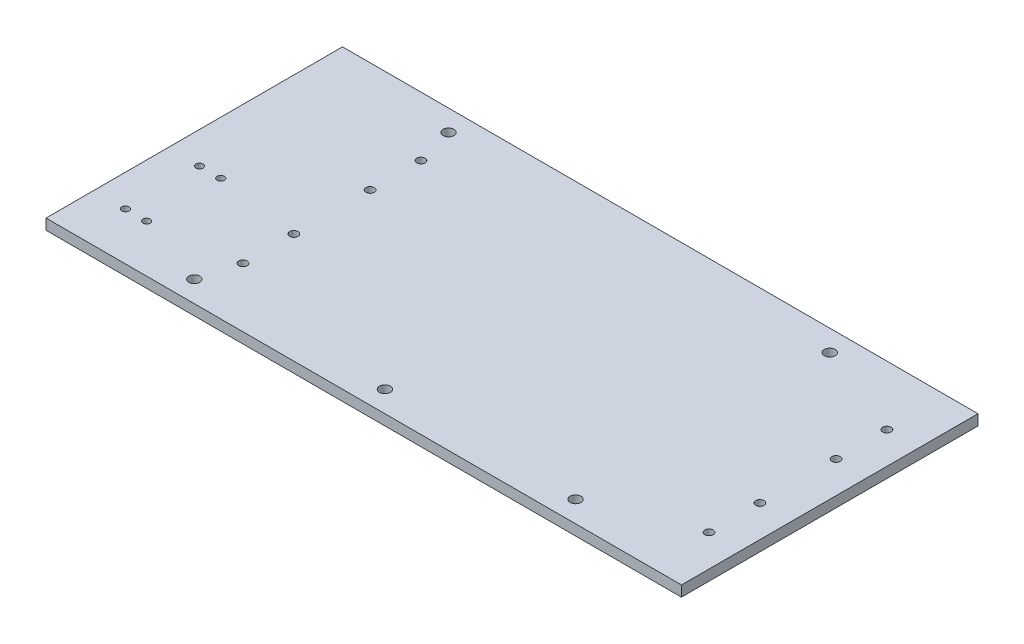
ISO-10303-21;
HEADER;
FILE_DESCRIPTION(('STEP AP214'),'2;1');
FILE_NAME('part.step','',(''),(''),'','','');
FILE_SCHEMA(('AUTOMOTIVE_DESIGN { 1 0 10303 214 1 1 1 1 }'));
ENDSEC;
DATA;
#1=APPLICATION_CONTEXT('core data for automotive mechanical design processes');
#2=APPLICATION_PROTOCOL_DEFINITION('international standard','automotive_design',2000,#1);
#3=PRODUCT_CONTEXT('',#1,'mechanical');
#4=PRODUCT('Part','Part','',(#3));
#5=PRODUCT_RELATED_PRODUCT_CATEGORY('part','',(#4));
#6=PRODUCT_DEFINITION_FORMATION('','',#4);
#7=PRODUCT_DEFINITION_CONTEXT('part definition',#1,'design');
#8=PRODUCT_DEFINITION('design','',#6,#7);
#9=PRODUCT_DEFINITION_SHAPE('','',#8);
#10=(LENGTH_UNIT() NAMED_UNIT(*) SI_UNIT(.MILLI.,.METRE.));
#11=(NAMED_UNIT(*) PLANE_ANGLE_UNIT() SI_UNIT($,.RADIAN.));
#12=(NAMED_UNIT(*) SI_UNIT($,.STERADIAN.) SOLID_ANGLE_UNIT());
#13=UNCERTAINTY_MEASURE_WITH_UNIT(LENGTH_MEASURE(1.E-05),#10,'distance_accuracy_value','');
#14=(GEOMETRIC_REPRESENTATION_CONTEXT(3) GLOBAL_UNCERTAINTY_ASSIGNED_CONTEXT((#13)) GLOBAL_UNIT_ASSIGNED_CONTEXT((#10,
#11,#12)) REPRESENTATION_CONTEXT('',''));
#15=CARTESIAN_POINT('',(0.,0.,0.));
#16=DIRECTION('',(0.,0.,1.));
#17=DIRECTION('',(1.,0.,0.));
#18=AXIS2_PLACEMENT_3D('',#15,#16,#17);
#19=CARTESIAN_POINT('',(-190.5,6.35,88.9));
#20=DIRECTION('',(1.,0.,0.));
#21=DIRECTION('',(0.,0.,-1.));
#22=AXIS2_PLACEMENT_3D('',#19,#20,#21);
#23=PLANE('',#22);
#24=DIRECTION('',(0.,0.,1.));
#25=VECTOR('',#24,1.);
#26=CARTESIAN_POINT('',(-190.5,0.,88.9));
#27=LINE('',#26,#25);
#28=CARTESIAN_POINT('',(-190.5,0.,-88.9));
#29=VERTEX_POINT('',#28);
#30=CARTESIAN_POINT('',(-190.5,0.,88.9));
#31=VERTEX_POINT('',#30);
#32=EDGE_CURVE('E111',#29,#31,#27,.T.);
#33=ORIENTED_EDGE('',*,*,#32,.T.);
#34=DIRECTION('',(0.,-1.,0.));
#35=VECTOR('',#34,1.);
#36=CARTESIAN_POINT('',(-190.5,6.35,88.9));
#37=LINE('',#36,#35);
#38=CARTESIAN_POINT('',(-190.5,6.35,88.9));
#39=VERTEX_POINT('',#38);
#40=EDGE_CURVE('E13',#39,#31,#37,.T.);
#41=ORIENTED_EDGE('',*,*,#40,.F.);
#42=DIRECTION('',(0.,0.,1.));
#43=VECTOR('',#42,1.);
#44=CARTESIAN_POINT('',(-190.5,6.35,88.9));
#45=LINE('',#44,#43);
#46=CARTESIAN_POINT('',(-190.5,6.35,-88.9));
#47=VERTEX_POINT('',#46);
#48=EDGE_CURVE('E99',#47,#39,#45,.T.);
#49=ORIENTED_EDGE('',*,*,#48,.F.);
#50=DIRECTION('',(0.,-1.,0.));
#51=VECTOR('',#50,1.);
#52=CARTESIAN_POINT('',(-190.5,6.35,-88.9));
#53=LINE('',#52,#51);
#54=EDGE_CURVE('E107',#47,#29,#53,.T.);
#55=ORIENTED_EDGE('',*,*,#54,.T.);
#56=EDGE_LOOP('',(#33,#41,#49,#55));
#57=FACE_BOUND('',#56,.T.);
#58=ADVANCED_FACE('F48',(#57),#23,.F.);
#59=CARTESIAN_POINT('',(-190.5,6.35,88.9));
#60=DIRECTION('',(0.,0.,-1.));
#61=DIRECTION('',(-1.,0.,0.));
#62=AXIS2_PLACEMENT_3D('',#59,#60,#61);
#63=PLANE('',#62);
#64=DIRECTION('',(1.,0.,0.));
#65=VECTOR('',#64,1.);
#66=CARTESIAN_POINT('',(-190.5,0.,88.9));
#67=LINE('',#66,#65);
#68=CARTESIAN_POINT('',(190.5,0.,88.9));
#69=VERTEX_POINT('',#68);
#70=EDGE_CURVE('E103',#31,#69,#67,.T.);
#71=ORIENTED_EDGE('',*,*,#70,.T.);
#72=DIRECTION('',(0.,-1.,0.));
#73=VECTOR('',#72,1.);
#74=CARTESIAN_POINT('',(190.5,6.35,88.9));
#75=LINE('',#74,#73);
#76=CARTESIAN_POINT('',(190.5,6.35,88.9));
#77=VERTEX_POINT('',#76);
#78=EDGE_CURVE('E56',#77,#69,#75,.T.);
#79=ORIENTED_EDGE('',*,*,#78,.F.);
#80=DIRECTION('',(1.,0.,0.));
#81=VECTOR('',#80,1.);
#82=CARTESIAN_POINT('',(-190.5,6.35,88.9));
#83=LINE('',#82,#81);
#84=EDGE_CURVE('E94',#39,#77,#83,.T.);
#85=ORIENTED_EDGE('',*,*,#84,.F.);
#86=ORIENTED_EDGE('',*,*,#40,.T.);
#87=EDGE_LOOP('',(#71,#79,#85,#86));
#88=FACE_BOUND('',#87,.T.);
#89=ADVANCED_FACE('F102',(#88),#63,.F.);
#90=CARTESIAN_POINT('',(190.5,6.35,88.9));
#91=DIRECTION('',(-1.,0.,0.));
#92=DIRECTION('',(0.,0.,1.));
#93=AXIS2_PLACEMENT_3D('',#90,#91,#92);
#94=PLANE('',#93);
#95=DIRECTION('',(0.,0.,-1.));
#96=VECTOR('',#95,1.);
#97=CARTESIAN_POINT('',(190.5,0.,88.9));
#98=LINE('',#97,#96);
#99=CARTESIAN_POINT('',(190.5,0.,-88.9));
#100=VERTEX_POINT('',#99);
#101=EDGE_CURVE('E81',#69,#100,#98,.T.);
#102=ORIENTED_EDGE('',*,*,#101,.T.);
#103=DIRECTION('',(0.,-1.,0.));
#104=VECTOR('',#103,1.);
#105=CARTESIAN_POINT('',(190.5,6.35,-88.9));
#106=LINE('',#105,#104);
#107=CARTESIAN_POINT('',(190.5,6.35,-88.9));
#108=VERTEX_POINT('',#107);
#109=EDGE_CURVE('E104',#108,#100,#106,.T.);
#110=ORIENTED_EDGE('',*,*,#109,.F.);
#111=DIRECTION('',(0.,0.,-1.));
#112=VECTOR('',#111,1.);
#113=CARTESIAN_POINT('',(190.5,6.35,88.9));
#114=LINE('',#113,#112);
#115=EDGE_CURVE('E97',#77,#108,#114,.T.);
#116=ORIENTED_EDGE('',*,*,#115,.F.);
#117=ORIENTED_EDGE('',*,*,#78,.T.);
#118=EDGE_LOOP('',(#102,#110,#116,#117));
#119=FACE_BOUND('',#118,.T.);
#120=ADVANCED_FACE('F105',(#119),#94,.F.);
#121=CARTESIAN_POINT('',(-190.5,6.35,-88.9));
#122=DIRECTION('',(0.,0.,1.));
#123=DIRECTION('',(1.,0.,0.));
#124=AXIS2_PLACEMENT_3D('',#121,#122,#123);
#125=PLANE('',#124);
#126=DIRECTION('',(-1.,0.,0.));
#127=VECTOR('',#126,1.);
#128=CARTESIAN_POINT('',(-190.5,0.,-88.9));
#129=LINE('',#128,#127);
#130=EDGE_CURVE('E87',#100,#29,#129,.T.);
#131=ORIENTED_EDGE('',*,*,#130,.T.);
#132=ORIENTED_EDGE('',*,*,#54,.F.);
#133=DIRECTION('',(-1.,0.,0.));
#134=VECTOR('',#133,1.);
#135=CARTESIAN_POINT('',(-190.5,6.35,-88.9));
#136=LINE('',#135,#134);
#137=EDGE_CURVE('E64',#108,#47,#136,.T.);
#138=ORIENTED_EDGE('',*,*,#137,.F.);
#139=ORIENTED_EDGE('',*,*,#109,.T.);
#140=EDGE_LOOP('',(#131,#132,#138,#139));
#141=FACE_BOUND('',#140,.T.);
#142=ADVANCED_FACE('F119',(#141),#125,.F.);
#143=CARTESIAN_POINT('',(0.,6.35,0.));
#144=DIRECTION('',(0.,-1.,0.));
#145=DIRECTION('',(0.,0.,-1.));
#146=AXIS2_PLACEMENT_3D('',#143,#144,#145);
#147=PLANE('',#146);
#148=CARTESIAN_POINT('',(-158.75,6.35,60.325));
#149=DIRECTION('',(0.,-1.,0.));
#150=DIRECTION('',(0.,0.,-1.));
#151=AXIS2_PLACEMENT_3D('',#148,#149,#150);
#152=CIRCLE('',#151,2.15265000000001);
#153=CARTESIAN_POINT('',(-158.75,6.35,58.17235));
#154=VERTEX_POINT('',#153);
#155=EDGE_CURVE('E208',#154,#154,#152,.F.);
#156=ORIENTED_EDGE('',*,*,#155,.F.);
#157=EDGE_LOOP('',(#156));
#158=FACE_BOUND('',#157,.T.);
#159=CARTESIAN_POINT('',(-171.45,6.35,15.875));
#160=DIRECTION('',(0.,-1.,0.));
#161=DIRECTION('',(0.,0.,-1.));
#162=AXIS2_PLACEMENT_3D('',#159,#160,#161);
#163=CIRCLE('',#162,2.15265000000001);
#164=CARTESIAN_POINT('',(-171.45,6.35,13.72235));
#165=VERTEX_POINT('',#164);
#166=EDGE_CURVE('E209',#165,#165,#163,.F.);
#167=ORIENTED_EDGE('',*,*,#166,.F.);
#168=EDGE_LOOP('',(#167));
#169=FACE_BOUND('',#168,.T.);
#170=CARTESIAN_POINT('',(-158.75,6.35,15.875));
#171=DIRECTION('',(0.,-1.,0.));
#172=DIRECTION('',(0.,0.,-1.));
#173=AXIS2_PLACEMENT_3D('',#170,#171,#172);
#174=CIRCLE('',#173,2.15265000000001);
#175=CARTESIAN_POINT('',(-158.75,6.35,13.72235));
#176=VERTEX_POINT('',#175);
#177=EDGE_CURVE('E216',#176,#176,#174,.F.);
#178=ORIENTED_EDGE('',*,*,#177,.F.);
#179=EDGE_LOOP('',(#178));
#180=FACE_BOUND('',#179,.T.);
#181=CARTESIAN_POINT('',(-171.45,6.35,60.325));
#182=DIRECTION('',(0.,-1.,0.));
#183=DIRECTION('',(0.,0.,-1.));
#184=AXIS2_PLACEMENT_3D('',#181,#182,#183);
#185=CIRCLE('',#184,2.15265000000001);
#186=CARTESIAN_POINT('',(-171.45,6.35,58.17235));
#187=VERTEX_POINT('',#186);
#188=EDGE_CURVE('E192',#187,#187,#185,.F.);
#189=ORIENTED_EDGE('',*,*,#188,.F.);
#190=EDGE_LOOP('',(#189));
#191=FACE_BOUND('',#190,.T.);
#192=CARTESIAN_POINT('',(-107.95,6.35,-22.86));
#193=DIRECTION('',(0.,-1.,0.));
#194=DIRECTION('',(0.,0.,-1.));
#195=AXIS2_PLACEMENT_3D('',#192,#193,#194);
#196=CIRCLE('',#195,2.5019);
#197=CARTESIAN_POINT('',(-107.95,6.35,-25.3619));
#198=VERTEX_POINT('',#197);
#199=EDGE_CURVE('E173',#198,#198,#196,.F.);
#200=ORIENTED_EDGE('',*,*,#199,.F.);
#201=EDGE_LOOP('',(#200));
#202=FACE_BOUND('',#201,.T.);
#203=CARTESIAN_POINT('',(171.45,6.35,-22.86));
#204=DIRECTION('',(0.,-1.,0.));
#205=DIRECTION('',(0.,0.,-1.));
#206=AXIS2_PLACEMENT_3D('',#203,#204,#205);
#207=CIRCLE('',#206,2.5019);
#208=CARTESIAN_POINT('',(171.45,6.35,-25.3619));
#209=VERTEX_POINT('',#208);
#210=EDGE_CURVE('E168',#209,#209,#207,.F.);
#211=ORIENTED_EDGE('',*,*,#210,.F.);
#212=EDGE_LOOP('',(#211));
#213=FACE_BOUND('',#212,.T.);
#214=CARTESIAN_POINT('',(171.45,6.35,-53.34));
#215=DIRECTION('',(0.,-1.,0.));
#216=DIRECTION('',(0.,0.,-1.));
#217=AXIS2_PLACEMENT_3D('',#214,#215,#216);
#218=CIRCLE('',#217,2.50190000000001);
#219=CARTESIAN_POINT('',(171.45,6.35,-55.8419));
#220=VERTEX_POINT('',#219);
#221=EDGE_CURVE('E161',#220,#220,#218,.F.);
#222=ORIENTED_EDGE('',*,*,#221,.F.);
#223=EDGE_LOOP('',(#222));
#224=FACE_BOUND('',#223,.T.);
#225=CARTESIAN_POINT('',(171.45,6.35,53.34));
#226=DIRECTION('',(0.,-1.,0.));
#227=DIRECTION('',(0.,0.,-1.));
#228=AXIS2_PLACEMENT_3D('',#225,#226,#227);
#229=CIRCLE('',#228,2.50190000000001);
#230=CARTESIAN_POINT('',(171.45,6.35,50.8381));
#231=VERTEX_POINT('',#230);
#232=EDGE_CURVE('E160',#231,#231,#229,.F.);
#233=ORIENTED_EDGE('',*,*,#232,.F.);
#234=EDGE_LOOP('',(#233));
#235=FACE_BOUND('',#234,.T.);
#236=CARTESIAN_POINT('',(-107.95,6.35,-53.34));
#237=DIRECTION('',(0.,-1.,0.));
#238=DIRECTION('',(0.,0.,-1.));
#239=AXIS2_PLACEMENT_3D('',#236,#237,#238);
#240=CIRCLE('',#239,2.50190000000001);
#241=CARTESIAN_POINT('',(-107.95,6.35,-55.8419));
#242=VERTEX_POINT('',#241);
#243=EDGE_CURVE('E180',#242,#242,#240,.F.);
#244=ORIENTED_EDGE('',*,*,#243,.F.);
#245=EDGE_LOOP('',(#244));
#246=FACE_BOUND('',#245,.T.);
#247=CARTESIAN_POINT('',(171.45,6.35,22.86));
#248=DIRECTION('',(0.,-1.,0.));
#249=DIRECTION('',(0.,0.,-1.));
#250=AXIS2_PLACEMENT_3D('',#247,#248,#249);
#251=CIRCLE('',#250,2.5019);
#252=CARTESIAN_POINT('',(171.45,6.35,20.3581));
#253=VERTEX_POINT('',#252);
#254=EDGE_CURVE('E193',#253,#253,#251,.F.);
#255=ORIENTED_EDGE('',*,*,#254,.F.);
#256=EDGE_LOOP('',(#255));
#257=FACE_BOUND('',#256,.T.);
#258=CARTESIAN_POINT('',(-107.95,6.35,53.34));
#259=DIRECTION('',(0.,-1.,0.));
#260=DIRECTION('',(0.,0.,-1.));
#261=AXIS2_PLACEMENT_3D('',#258,#259,#260);
#262=CIRCLE('',#261,2.50190000000001);
#263=CARTESIAN_POINT('',(-107.95,6.35,50.8381));
#264=VERTEX_POINT('',#263);
#265=EDGE_CURVE('E185',#264,#264,#262,.F.);
#266=ORIENTED_EDGE('',*,*,#265,.F.);
#267=EDGE_LOOP('',(#266));
#268=FACE_BOUND('',#267,.T.);
#269=CARTESIAN_POINT('',(-107.95,6.35,22.86));
#270=DIRECTION('',(0.,-1.,0.));
#271=DIRECTION('',(0.,0.,-1.));
#272=AXIS2_PLACEMENT_3D('',#269,#270,#271);
#273=CIRCLE('',#272,2.5019);
#274=CARTESIAN_POINT('',(-107.95,6.35,20.3581));
#275=VERTEX_POINT('',#274);
#276=EDGE_CURVE('E138',#275,#275,#273,.F.);
#277=ORIENTED_EDGE('',*,*,#276,.F.);
#278=EDGE_LOOP('',(#277));
#279=FACE_BOUND('',#278,.T.);
#280=CARTESIAN_POINT('',(114.3,6.35,-76.2));
#281=DIRECTION('',(0.,-1.,0.));
#282=DIRECTION('',(0.,0.,-1.));
#283=AXIS2_PLACEMENT_3D('',#280,#281,#282);
#284=CIRCLE('',#283,3.26389999999999);
#285=CARTESIAN_POINT('',(114.3,6.35,-79.4639));
#286=VERTEX_POINT('',#285);
#287=EDGE_CURVE('E131',#286,#286,#284,.F.);
#288=ORIENTED_EDGE('',*,*,#287,.F.);
#289=EDGE_LOOP('',(#288));
#290=FACE_BOUND('',#289,.T.);
#291=CARTESIAN_POINT('',(-114.3,6.35,-76.2));
#292=DIRECTION('',(0.,-1.,0.));
#293=DIRECTION('',(0.,0.,-1.));
#294=AXIS2_PLACEMENT_3D('',#291,#292,#293);
#295=CIRCLE('',#294,3.26389999999999);
#296=CARTESIAN_POINT('',(-114.3,6.35,-79.4639));
#297=VERTEX_POINT('',#296);
#298=EDGE_CURVE('E139',#297,#297,#295,.F.);
#299=ORIENTED_EDGE('',*,*,#298,.F.);
#300=EDGE_LOOP('',(#299));
#301=FACE_BOUND('',#300,.T.);
#302=CARTESIAN_POINT('',(114.3,6.35,76.2));
#303=DIRECTION('',(0.,-1.,0.));
#304=DIRECTION('',(0.,0.,-1.));
#305=AXIS2_PLACEMENT_3D('',#302,#303,#304);
#306=CIRCLE('',#305,3.26389999999999);
#307=CARTESIAN_POINT('',(114.3,6.35,72.9361));
#308=VERTEX_POINT('',#307);
#309=EDGE_CURVE('E145',#308,#308,#306,.F.);
#310=ORIENTED_EDGE('',*,*,#309,.F.);
#311=EDGE_LOOP('',(#310));
#312=FACE_BOUND('',#311,.T.);
#313=CARTESIAN_POINT('',(-114.3,6.35,76.2));
#314=DIRECTION('',(0.,-1.,0.));
#315=DIRECTION('',(0.,0.,-1.));
#316=AXIS2_PLACEMENT_3D('',#313,#314,#315);
#317=CIRCLE('',#316,3.26389999999999);
#318=CARTESIAN_POINT('',(-114.3,6.35,72.9361));
#319=VERTEX_POINT('',#318);
#320=EDGE_CURVE('E130',#319,#319,#317,.F.);
#321=ORIENTED_EDGE('',*,*,#320,.F.);
#322=EDGE_LOOP('',(#321));
#323=FACE_BOUND('',#322,.T.);
#324=CARTESIAN_POINT('',(0.,6.35,76.2));
#325=DIRECTION('',(0.,-1.,0.));
#326=DIRECTION('',(0.,0.,-1.));
#327=AXIS2_PLACEMENT_3D('',#324,#325,#326);
#328=CIRCLE('',#327,3.2639);
#329=CARTESIAN_POINT('',(0.,6.35,72.9361));
#330=VERTEX_POINT('',#329);
#331=EDGE_CURVE('E114',#330,#330,#328,.F.);
#332=ORIENTED_EDGE('',*,*,#331,.F.);
#333=EDGE_LOOP('',(#332));
#334=FACE_BOUND('',#333,.T.);
#335=ORIENTED_EDGE('',*,*,#48,.T.);
#336=ORIENTED_EDGE('',*,*,#84,.T.);
#337=ORIENTED_EDGE('',*,*,#115,.T.);
#338=ORIENTED_EDGE('',*,*,#137,.T.);
#339=EDGE_LOOP('',(#335,#336,#337,#338));
#340=FACE_BOUND('',#339,.T.);
#341=ADVANCED_FACE('F95',(#158,#169,#180,#191,#202,#213,#224,#235,#246,#257,#268,#279,#290,#301,
#312,#323,#334,#340),#147,.F.);
#342=CARTESIAN_POINT('',(0.,0.,0.));
#343=DIRECTION('',(0.,-1.,0.));
#344=DIRECTION('',(0.,0.,-1.));
#345=AXIS2_PLACEMENT_3D('',#342,#343,#344);
#346=PLANE('',#345);
#347=CARTESIAN_POINT('',(-158.75,0.,60.325));
#348=DIRECTION('',(0.,-1.,0.));
#349=DIRECTION('',(0.,0.,-1.));
#350=AXIS2_PLACEMENT_3D('',#347,#348,#349);
#351=CIRCLE('',#350,2.15265000000001);
#352=CARTESIAN_POINT('',(-158.75,0.,58.17235));
#353=VERTEX_POINT('',#352);
#354=EDGE_CURVE('E212',#353,#353,#351,.T.);
#355=ORIENTED_EDGE('',*,*,#354,.F.);
#356=EDGE_LOOP('',(#355));
#357=FACE_BOUND('',#356,.T.);
#358=CARTESIAN_POINT('',(-171.45,0.,15.875));
#359=DIRECTION('',(0.,-1.,0.));
#360=DIRECTION('',(0.,0.,-1.));
#361=AXIS2_PLACEMENT_3D('',#358,#359,#360);
#362=CIRCLE('',#361,2.15265000000001);
#363=CARTESIAN_POINT('',(-171.45,0.,13.72235));
#364=VERTEX_POINT('',#363);
#365=EDGE_CURVE('E213',#364,#364,#362,.T.);
#366=ORIENTED_EDGE('',*,*,#365,.F.);
#367=EDGE_LOOP('',(#366));
#368=FACE_BOUND('',#367,.T.);
#369=CARTESIAN_POINT('',(-158.75,0.,15.875));
#370=DIRECTION('',(0.,-1.,0.));
#371=DIRECTION('',(0.,0.,-1.));
#372=AXIS2_PLACEMENT_3D('',#369,#370,#371);
#373=CIRCLE('',#372,2.15265000000001);
#374=CARTESIAN_POINT('',(-158.75,0.,13.72235));
#375=VERTEX_POINT('',#374);
#376=EDGE_CURVE('E223',#375,#375,#373,.T.);
#377=ORIENTED_EDGE('',*,*,#376,.F.);
#378=EDGE_LOOP('',(#377));
#379=FACE_BOUND('',#378,.T.);
#380=CARTESIAN_POINT('',(-171.45,0.,60.325));
#381=DIRECTION('',(0.,-1.,0.));
#382=DIRECTION('',(0.,0.,-1.));
#383=AXIS2_PLACEMENT_3D('',#380,#381,#382);
#384=CIRCLE('',#383,2.15265000000001);
#385=CARTESIAN_POINT('',(-171.45,0.,58.17235));
#386=VERTEX_POINT('',#385);
#387=EDGE_CURVE('E205',#386,#386,#384,.T.);
#388=ORIENTED_EDGE('',*,*,#387,.F.);
#389=EDGE_LOOP('',(#388));
#390=FACE_BOUND('',#389,.T.);
#391=CARTESIAN_POINT('',(-107.95,0.,-22.86));
#392=DIRECTION('',(0.,-1.,0.));
#393=DIRECTION('',(0.,0.,1.));
#394=AXIS2_PLACEMENT_3D('',#391,#392,#393);
#395=CIRCLE('',#394,2.5019);
#396=CARTESIAN_POINT('',(-107.95,0.,-20.3581));
#397=VERTEX_POINT('',#396);
#398=EDGE_CURVE('E177',#397,#397,#395,.T.);
#399=ORIENTED_EDGE('',*,*,#398,.F.);
#400=EDGE_LOOP('',(#399));
#401=FACE_BOUND('',#400,.T.);
#402=CARTESIAN_POINT('',(171.45,0.,-22.86));
#403=DIRECTION('',(0.,-1.,0.));
#404=DIRECTION('',(0.,0.,1.));
#405=AXIS2_PLACEMENT_3D('',#402,#403,#404);
#406=CIRCLE('',#405,2.5019);
#407=CARTESIAN_POINT('',(171.45,0.,-20.3581));
#408=VERTEX_POINT('',#407);
#409=EDGE_CURVE('E176',#408,#408,#406,.T.);
#410=ORIENTED_EDGE('',*,*,#409,.F.);
#411=EDGE_LOOP('',(#410));
#412=FACE_BOUND('',#411,.T.);
#413=CARTESIAN_POINT('',(171.45,0.,-53.34));
#414=DIRECTION('',(0.,-1.,0.));
#415=DIRECTION('',(0.,0.,1.));
#416=AXIS2_PLACEMENT_3D('',#413,#414,#415);
#417=CIRCLE('',#416,2.50190000000001);
#418=CARTESIAN_POINT('',(171.45,0.,-50.8381));
#419=VERTEX_POINT('',#418);
#420=EDGE_CURVE('E165',#419,#419,#417,.T.);
#421=ORIENTED_EDGE('',*,*,#420,.F.);
#422=EDGE_LOOP('',(#421));
#423=FACE_BOUND('',#422,.T.);
#424=CARTESIAN_POINT('',(171.45,0.,53.34));
#425=DIRECTION('',(0.,-1.,0.));
#426=DIRECTION('',(0.,0.,-1.));
#427=AXIS2_PLACEMENT_3D('',#424,#425,#426);
#428=CIRCLE('',#427,2.50190000000001);
#429=CARTESIAN_POINT('',(171.45,0.,50.8381));
#430=VERTEX_POINT('',#429);
#431=EDGE_CURVE('E164',#430,#430,#428,.T.);
#432=ORIENTED_EDGE('',*,*,#431,.F.);
#433=EDGE_LOOP('',(#432));
#434=FACE_BOUND('',#433,.T.);
#435=CARTESIAN_POINT('',(-107.95,0.,-53.34));
#436=DIRECTION('',(0.,-1.,0.));
#437=DIRECTION('',(0.,0.,-1.));
#438=AXIS2_PLACEMENT_3D('',#435,#436,#437);
#439=CIRCLE('',#438,2.50190000000001);
#440=CARTESIAN_POINT('',(-107.95,0.,-55.8419));
#441=VERTEX_POINT('',#440);
#442=EDGE_CURVE('E196',#441,#441,#439,.T.);
#443=ORIENTED_EDGE('',*,*,#442,.F.);
#444=EDGE_LOOP('',(#443));
#445=FACE_BOUND('',#444,.T.);
#446=CARTESIAN_POINT('',(171.45,0.,22.86));
#447=DIRECTION('',(0.,-1.,0.));
#448=DIRECTION('',(0.,0.,-1.));
#449=AXIS2_PLACEMENT_3D('',#446,#447,#448);
#450=CIRCLE('',#449,2.5019);
#451=CARTESIAN_POINT('',(171.45,0.,20.3581));
#452=VERTEX_POINT('',#451);
#453=EDGE_CURVE('E188',#452,#452,#450,.T.);
#454=ORIENTED_EDGE('',*,*,#453,.F.);
#455=EDGE_LOOP('',(#454));
#456=FACE_BOUND('',#455,.T.);
#457=CARTESIAN_POINT('',(-107.95,0.,53.34));
#458=DIRECTION('',(0.,-1.,0.));
#459=DIRECTION('',(0.,0.,1.));
#460=AXIS2_PLACEMENT_3D('',#457,#458,#459);
#461=CIRCLE('',#460,2.50190000000001);
#462=CARTESIAN_POINT('',(-107.95,0.,55.8419));
#463=VERTEX_POINT('',#462);
#464=EDGE_CURVE('E189',#463,#463,#461,.T.);
#465=ORIENTED_EDGE('',*,*,#464,.F.);
#466=EDGE_LOOP('',(#465));
#467=FACE_BOUND('',#466,.T.);
#468=CARTESIAN_POINT('',(-107.95,0.,22.86));
#469=DIRECTION('',(0.,-1.,0.));
#470=DIRECTION('',(0.,0.,-1.));
#471=AXIS2_PLACEMENT_3D('',#468,#469,#470);
#472=CIRCLE('',#471,2.5019);
#473=CARTESIAN_POINT('',(-107.95,0.,20.3581));
#474=VERTEX_POINT('',#473);
#475=EDGE_CURVE('E157',#474,#474,#472,.T.);
#476=ORIENTED_EDGE('',*,*,#475,.F.);
#477=EDGE_LOOP('',(#476));
#478=FACE_BOUND('',#477,.T.);
#479=CARTESIAN_POINT('',(114.3,0.,-76.2));
#480=DIRECTION('',(0.,-1.,0.));
#481=DIRECTION('',(0.,0.,-1.));
#482=AXIS2_PLACEMENT_3D('',#479,#480,#481);
#483=CIRCLE('',#482,3.26389999999999);
#484=CARTESIAN_POINT('',(114.3,0.,-79.4639));
#485=VERTEX_POINT('',#484);
#486=EDGE_CURVE('E135',#485,#485,#483,.T.);
#487=ORIENTED_EDGE('',*,*,#486,.F.);
#488=EDGE_LOOP('',(#487));
#489=FACE_BOUND('',#488,.T.);
#490=CARTESIAN_POINT('',(-114.3,0.,-76.2));
#491=DIRECTION('',(0.,-1.,0.));
#492=DIRECTION('',(0.,0.,-1.));
#493=AXIS2_PLACEMENT_3D('',#490,#491,#492);
#494=CIRCLE('',#493,3.26389999999999);
#495=CARTESIAN_POINT('',(-114.3,0.,-79.4639));
#496=VERTEX_POINT('',#495);
#497=EDGE_CURVE('E134',#496,#496,#494,.T.);
#498=ORIENTED_EDGE('',*,*,#497,.F.);
#499=EDGE_LOOP('',(#498));
#500=FACE_BOUND('',#499,.T.);
#501=CARTESIAN_POINT('',(114.3,0.,76.2));
#502=DIRECTION('',(0.,-1.,0.));
#503=DIRECTION('',(0.,0.,-1.));
#504=AXIS2_PLACEMENT_3D('',#501,#502,#503);
#505=CIRCLE('',#504,3.26389999999999);
#506=CARTESIAN_POINT('',(114.3,0.,72.9361));
#507=VERTEX_POINT('',#506);
#508=EDGE_CURVE('E142',#507,#507,#505,.T.);
#509=ORIENTED_EDGE('',*,*,#508,.F.);
#510=EDGE_LOOP('',(#509));
#511=FACE_BOUND('',#510,.T.);
#512=CARTESIAN_POINT('',(-114.3,0.,76.2));
#513=DIRECTION('',(0.,-1.,0.));
#514=DIRECTION('',(0.,0.,-1.));
#515=AXIS2_PLACEMENT_3D('',#512,#513,#514);
#516=CIRCLE('',#515,3.26389999999999);
#517=CARTESIAN_POINT('',(-114.3,0.,72.9361));
#518=VERTEX_POINT('',#517);
#519=EDGE_CURVE('E148',#518,#518,#516,.T.);
#520=ORIENTED_EDGE('',*,*,#519,.F.);
#521=EDGE_LOOP('',(#520));
#522=FACE_BOUND('',#521,.T.);
#523=CARTESIAN_POINT('',(0.,0.,76.2));
#524=DIRECTION('',(0.,-1.,0.));
#525=DIRECTION('',(0.,0.,-1.));
#526=AXIS2_PLACEMENT_3D('',#523,#524,#525);
#527=CIRCLE('',#526,3.2639);
#528=CARTESIAN_POINT('',(0.,0.,72.9361));
#529=VERTEX_POINT('',#528);
#530=EDGE_CURVE('E127',#529,#529,#527,.T.);
#531=ORIENTED_EDGE('',*,*,#530,.F.);
#532=EDGE_LOOP('',(#531));
#533=FACE_BOUND('',#532,.T.);
#534=ORIENTED_EDGE('',*,*,#32,.F.);
#535=ORIENTED_EDGE('',*,*,#130,.F.);
#536=ORIENTED_EDGE('',*,*,#101,.F.);
#537=ORIENTED_EDGE('',*,*,#70,.F.);
#538=EDGE_LOOP('',(#534,#535,#536,#537));
#539=FACE_BOUND('',#538,.T.);
#540=ADVANCED_FACE('F122',(#357,#368,#379,#390,#401,#412,#423,#434,#445,#456,#467,#478,#489,
#500,#511,#522,#533,#539),#346,.T.);
#541=CARTESIAN_POINT('',(0.,15.5817032924591,76.2));
#542=DIRECTION('',(0.,-1.,0.));
#543=DIRECTION('',(0.,0.,-1.));
#544=AXIS2_PLACEMENT_3D('',#541,#542,#543);
#545=CYLINDRICAL_SURFACE('',#544,3.2639);
#546=ORIENTED_EDGE('',*,*,#331,.T.);
#547=EDGE_LOOP('',(#546));
#548=FACE_BOUND('',#547,.T.);
#549=ORIENTED_EDGE('',*,*,#530,.T.);
#550=EDGE_LOOP('',(#549));
#551=FACE_BOUND('',#550,.T.);
#552=ADVANCED_FACE('F231',(#548,#551),#545,.F.);
#553=CARTESIAN_POINT('',(-114.3,15.5817032924591,76.2));
#554=DIRECTION('',(0.,-1.,0.));
#555=DIRECTION('',(0.,0.,-1.));
#556=AXIS2_PLACEMENT_3D('',#553,#554,#555);
#557=CYLINDRICAL_SURFACE('',#556,3.26389999999999);
#558=ORIENTED_EDGE('',*,*,#320,.T.);
#559=EDGE_LOOP('',(#558));
#560=FACE_BOUND('',#559,.T.);
#561=ORIENTED_EDGE('',*,*,#519,.T.);
#562=EDGE_LOOP('',(#561));
#563=FACE_BOUND('',#562,.T.);
#564=ADVANCED_FACE('F263',(#560,#563),#557,.F.);
#565=CARTESIAN_POINT('',(114.3,15.5817032924591,76.2));
#566=DIRECTION('',(0.,-1.,0.));
#567=DIRECTION('',(0.,0.,-1.));
#568=AXIS2_PLACEMENT_3D('',#565,#566,#567);
#569=CYLINDRICAL_SURFACE('',#568,3.26389999999999);
#570=ORIENTED_EDGE('',*,*,#309,.T.);
#571=EDGE_LOOP('',(#570));
#572=FACE_BOUND('',#571,.T.);
#573=ORIENTED_EDGE('',*,*,#508,.T.);
#574=EDGE_LOOP('',(#573));
#575=FACE_BOUND('',#574,.T.);
#576=ADVANCED_FACE('F269',(#572,#575),#569,.F.);
#577=CARTESIAN_POINT('',(-114.3,15.5817032924591,-76.2));
#578=DIRECTION('',(0.,-1.,0.));
#579=DIRECTION('',(0.,0.,-1.));
#580=AXIS2_PLACEMENT_3D('',#577,#578,#579);
#581=CYLINDRICAL_SURFACE('',#580,3.26389999999999);
#582=ORIENTED_EDGE('',*,*,#298,.T.);
#583=EDGE_LOOP('',(#582));
#584=FACE_BOUND('',#583,.T.);
#585=ORIENTED_EDGE('',*,*,#497,.T.);
#586=EDGE_LOOP('',(#585));
#587=FACE_BOUND('',#586,.T.);
#588=ADVANCED_FACE('F325',(#584,#587),#581,.F.);
#589=CARTESIAN_POINT('',(114.3,15.5817032924591,-76.2));
#590=DIRECTION('',(0.,-1.,0.));
#591=DIRECTION('',(0.,0.,-1.));
#592=AXIS2_PLACEMENT_3D('',#589,#590,#591);
#593=CYLINDRICAL_SURFACE('',#592,3.26389999999999);
#594=ORIENTED_EDGE('',*,*,#287,.T.);
#595=EDGE_LOOP('',(#594));
#596=FACE_BOUND('',#595,.T.);
#597=ORIENTED_EDGE('',*,*,#486,.T.);
#598=EDGE_LOOP('',(#597));
#599=FACE_BOUND('',#598,.T.);
#600=ADVANCED_FACE('F330',(#596,#599),#593,.F.);
#601=CARTESIAN_POINT('',(-107.95,13.4264418234025,22.86));
#602=DIRECTION('',(0.,-1.,0.));
#603=DIRECTION('',(0.,0.,-1.));
#604=AXIS2_PLACEMENT_3D('',#601,#602,#603);
#605=CYLINDRICAL_SURFACE('',#604,2.5019);
#606=ORIENTED_EDGE('',*,*,#276,.T.);
#607=EDGE_LOOP('',(#606));
#608=FACE_BOUND('',#607,.T.);
#609=ORIENTED_EDGE('',*,*,#475,.T.);
#610=EDGE_LOOP('',(#609));
#611=FACE_BOUND('',#610,.T.);
#612=ADVANCED_FACE('F335',(#608,#611),#605,.F.);
#613=CARTESIAN_POINT('',(-107.95,13.4264418234025,53.34));
#614=DIRECTION('',(0.,-1.,0.));
#615=DIRECTION('',(0.,0.,-1.));
#616=AXIS2_PLACEMENT_3D('',#613,#614,#615);
#617=CYLINDRICAL_SURFACE('',#616,2.50190000000001);
#618=ORIENTED_EDGE('',*,*,#265,.T.);
#619=EDGE_LOOP('',(#618));
#620=FACE_BOUND('',#619,.T.);
#621=ORIENTED_EDGE('',*,*,#464,.T.);
#622=EDGE_LOOP('',(#621));
#623=FACE_BOUND('',#622,.T.);
#624=ADVANCED_FACE('F340',(#620,#623),#617,.F.);
#625=CARTESIAN_POINT('',(171.45,13.4264418234025,22.86));
#626=DIRECTION('',(0.,-1.,0.));
#627=DIRECTION('',(0.,0.,-1.));
#628=AXIS2_PLACEMENT_3D('',#625,#626,#627);
#629=CYLINDRICAL_SURFACE('',#628,2.5019);
#630=ORIENTED_EDGE('',*,*,#254,.T.);
#631=EDGE_LOOP('',(#630));
#632=FACE_BOUND('',#631,.T.);
#633=ORIENTED_EDGE('',*,*,#453,.T.);
#634=EDGE_LOOP('',(#633));
#635=FACE_BOUND('',#634,.T.);
#636=ADVANCED_FACE('F346',(#632,#635),#629,.F.);
#637=CARTESIAN_POINT('',(-107.95,13.4264418234025,-53.34));
#638=DIRECTION('',(0.,-1.,0.));
#639=DIRECTION('',(0.,0.,-1.));
#640=AXIS2_PLACEMENT_3D('',#637,#638,#639);
#641=CYLINDRICAL_SURFACE('',#640,2.50190000000001);
#642=ORIENTED_EDGE('',*,*,#243,.T.);
#643=EDGE_LOOP('',(#642));
#644=FACE_BOUND('',#643,.T.);
#645=ORIENTED_EDGE('',*,*,#442,.T.);
#646=EDGE_LOOP('',(#645));
#647=FACE_BOUND('',#646,.T.);
#648=ADVANCED_FACE('F359',(#644,#647),#641,.F.);
#649=CARTESIAN_POINT('',(171.45,13.4264418234025,53.34));
#650=DIRECTION('',(0.,-1.,0.));
#651=DIRECTION('',(0.,0.,-1.));
#652=AXIS2_PLACEMENT_3D('',#649,#650,#651);
#653=CYLINDRICAL_SURFACE('',#652,2.50190000000001);
#654=ORIENTED_EDGE('',*,*,#232,.T.);
#655=EDGE_LOOP('',(#654));
#656=FACE_BOUND('',#655,.T.);
#657=ORIENTED_EDGE('',*,*,#431,.T.);
#658=EDGE_LOOP('',(#657));
#659=FACE_BOUND('',#658,.T.);
#660=ADVANCED_FACE('F355',(#656,#659),#653,.F.);
#661=CARTESIAN_POINT('',(171.45,13.4264418234025,-53.34));
#662=DIRECTION('',(0.,-1.,0.));
#663=DIRECTION('',(0.,0.,-1.));
#664=AXIS2_PLACEMENT_3D('',#661,#662,#663);
#665=CYLINDRICAL_SURFACE('',#664,2.50190000000001);
#666=ORIENTED_EDGE('',*,*,#221,.T.);
#667=EDGE_LOOP('',(#666));
#668=FACE_BOUND('',#667,.T.);
#669=ORIENTED_EDGE('',*,*,#420,.T.);
#670=EDGE_LOOP('',(#669));
#671=FACE_BOUND('',#670,.T.);
#672=ADVANCED_FACE('F351',(#668,#671),#665,.F.);
#673=CARTESIAN_POINT('',(171.45,13.4264418234025,-22.86));
#674=DIRECTION('',(0.,-1.,0.));
#675=DIRECTION('',(0.,0.,-1.));
#676=AXIS2_PLACEMENT_3D('',#673,#674,#675);
#677=CYLINDRICAL_SURFACE('',#676,2.5019);
#678=ORIENTED_EDGE('',*,*,#210,.T.);
#679=EDGE_LOOP('',(#678));
#680=FACE_BOUND('',#679,.T.);
#681=ORIENTED_EDGE('',*,*,#409,.T.);
#682=EDGE_LOOP('',(#681));
#683=FACE_BOUND('',#682,.T.);
#684=ADVANCED_FACE('F354',(#680,#683),#677,.F.);
#685=CARTESIAN_POINT('',(-107.95,13.4264418234025,-22.86));
#686=DIRECTION('',(0.,-1.,0.));
#687=DIRECTION('',(0.,0.,-1.));
#688=AXIS2_PLACEMENT_3D('',#685,#686,#687);
#689=CYLINDRICAL_SURFACE('',#688,2.5019);
#690=ORIENTED_EDGE('',*,*,#199,.T.);
#691=EDGE_LOOP('',(#690));
#692=FACE_BOUND('',#691,.T.);
#693=ORIENTED_EDGE('',*,*,#398,.T.);
#694=EDGE_LOOP('',(#693));
#695=FACE_BOUND('',#694,.T.);
#696=ADVANCED_FACE('F361',(#692,#695),#689,.F.);
#697=CARTESIAN_POINT('',(-171.45,12.4386136500849,60.325));
#698=DIRECTION('',(0.,-1.,0.));
#699=DIRECTION('',(0.,0.,-1.));
#700=AXIS2_PLACEMENT_3D('',#697,#698,#699);
#701=CYLINDRICAL_SURFACE('',#700,2.15265000000001);
#702=ORIENTED_EDGE('',*,*,#188,.T.);
#703=EDGE_LOOP('',(#702));
#704=FACE_BOUND('',#703,.T.);
#705=ORIENTED_EDGE('',*,*,#387,.T.);
#706=EDGE_LOOP('',(#705));
#707=FACE_BOUND('',#706,.T.);
#708=ADVANCED_FACE('F364',(#704,#707),#701,.F.);
#709=CARTESIAN_POINT('',(-158.75,12.4386136500849,15.875));
#710=DIRECTION('',(0.,-1.,0.));
#711=DIRECTION('',(0.,0.,-1.));
#712=AXIS2_PLACEMENT_3D('',#709,#710,#711);
#713=CYLINDRICAL_SURFACE('',#712,2.15265000000001);
#714=ORIENTED_EDGE('',*,*,#177,.T.);
#715=EDGE_LOOP('',(#714));
#716=FACE_BOUND('',#715,.T.);
#717=ORIENTED_EDGE('',*,*,#376,.T.);
#718=EDGE_LOOP('',(#717));
#719=FACE_BOUND('',#718,.T.);
#720=ADVANCED_FACE('F227',(#716,#719),#713,.F.);
#721=CARTESIAN_POINT('',(-171.45,12.4386136500849,15.875));
#722=DIRECTION('',(0.,-1.,0.));
#723=DIRECTION('',(0.,0.,-1.));
#724=AXIS2_PLACEMENT_3D('',#721,#722,#723);
#725=CYLINDRICAL_SURFACE('',#724,2.15265000000001);
#726=ORIENTED_EDGE('',*,*,#166,.T.);
#727=EDGE_LOOP('',(#726));
#728=FACE_BOUND('',#727,.T.);
#729=ORIENTED_EDGE('',*,*,#365,.T.);
#730=EDGE_LOOP('',(#729));
#731=FACE_BOUND('',#730,.T.);
#732=ADVANCED_FACE('F378',(#728,#731),#725,.F.);
#733=CARTESIAN_POINT('',(-158.75,12.4386136500849,60.325));
#734=DIRECTION('',(0.,-1.,0.));
#735=DIRECTION('',(0.,0.,-1.));
#736=AXIS2_PLACEMENT_3D('',#733,#734,#735);
#737=CYLINDRICAL_SURFACE('',#736,2.15265000000001);
#738=ORIENTED_EDGE('',*,*,#155,.T.);
#739=EDGE_LOOP('',(#738));
#740=FACE_BOUND('',#739,.T.);
#741=ORIENTED_EDGE('',*,*,#354,.T.);
#742=EDGE_LOOP('',(#741));
#743=FACE_BOUND('',#742,.T.);
#744=ADVANCED_FACE('F381',(#740,#743),#737,.F.);
#745=CLOSED_SHELL('',(#58,#89,#120,#142,#341,#540,#552,#564,#576,#588,#600,#612,#624,#636,#648,
#660,#672,#684,#696,#708,#720,#732,#744));
#746=MANIFOLD_SOLID_BREP('B2',#745);
#747=ADVANCED_BREP_SHAPE_REPRESENTATION('',(#18,#746),#14);
#748=SHAPE_DEFINITION_REPRESENTATION(#9,#747);
ENDSEC;
END-ISO-10303-21;
